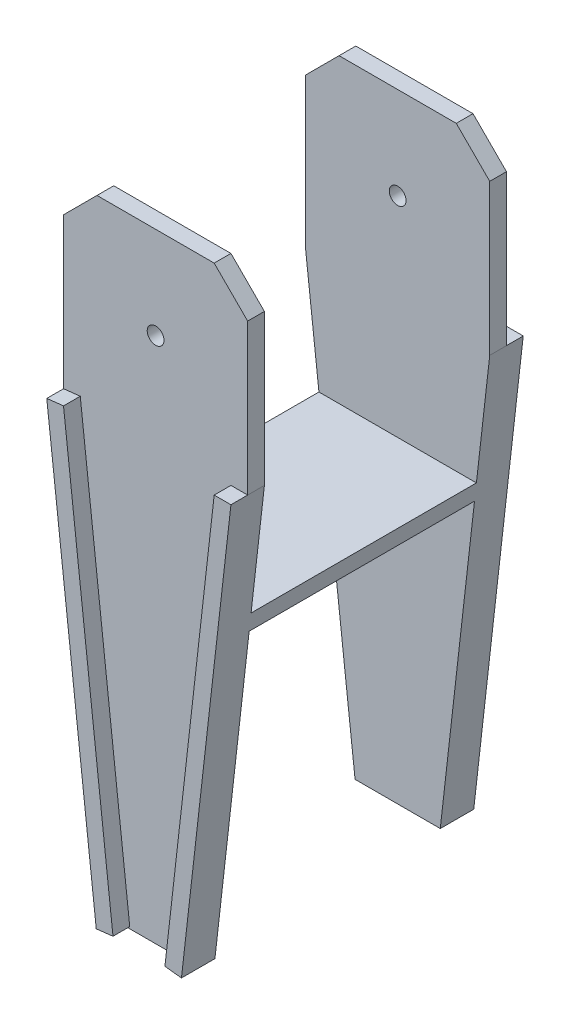
ISO-10303-21;
HEADER;
FILE_DESCRIPTION(('STEP AP214'),'2;1');
FILE_NAME('part.step','',(''),(''),'','','');
FILE_SCHEMA(('AUTOMOTIVE_DESIGN { 1 0 10303 214 1 1 1 1 }'));
ENDSEC;
DATA;
#1=APPLICATION_CONTEXT('core data for automotive mechanical design processes');
#2=APPLICATION_PROTOCOL_DEFINITION('international standard','automotive_design',2000,#1);
#3=PRODUCT_CONTEXT('',#1,'mechanical');
#4=PRODUCT('Part','Part','',(#3));
#5=PRODUCT_RELATED_PRODUCT_CATEGORY('part','',(#4));
#6=PRODUCT_DEFINITION_FORMATION('','',#4);
#7=PRODUCT_DEFINITION_CONTEXT('part definition',#1,'design');
#8=PRODUCT_DEFINITION('design','',#6,#7);
#9=PRODUCT_DEFINITION_SHAPE('','',#8);
#10=(LENGTH_UNIT() NAMED_UNIT(*) SI_UNIT(.MILLI.,.METRE.));
#11=(NAMED_UNIT(*) PLANE_ANGLE_UNIT() SI_UNIT($,.RADIAN.));
#12=(NAMED_UNIT(*) SI_UNIT($,.STERADIAN.) SOLID_ANGLE_UNIT());
#13=UNCERTAINTY_MEASURE_WITH_UNIT(LENGTH_MEASURE(1.E-05),#10,'distance_accuracy_value','');
#14=(GEOMETRIC_REPRESENTATION_CONTEXT(3) GLOBAL_UNCERTAINTY_ASSIGNED_CONTEXT((#13)) GLOBAL_UNIT_ASSIGNED_CONTEXT((#10,
#11,#12)) REPRESENTATION_CONTEXT('',''));
#15=CARTESIAN_POINT('',(0.,0.,0.));
#16=DIRECTION('',(0.,0.,1.));
#17=DIRECTION('',(1.,0.,0.));
#18=AXIS2_PLACEMENT_3D('',#15,#16,#17);
#19=CARTESIAN_POINT('',(0.,0.,-72.3));
#20=DIRECTION('',(0.,0.,-1.));
#21=DIRECTION('',(-1.,0.,0.));
#22=AXIS2_PLACEMENT_3D('',#19,#20,#21);
#23=PLANE('',#22);
#24=CARTESIAN_POINT('',(0.,0.,-72.3));
#25=DIRECTION('',(0.,0.,-1.));
#26=DIRECTION('',(-1.,0.,0.));
#27=AXIS2_PLACEMENT_3D('',#24,#25,#26);
#28=CIRCLE('',#27,2.5);
#29=CARTESIAN_POINT('',(-2.5,0.,-72.3));
#30=VERTEX_POINT('',#29);
#31=EDGE_CURVE('E388',#30,#30,#28,.T.);
#32=ORIENTED_EDGE('',*,*,#31,.F.);
#33=EDGE_LOOP('',(#32));
#34=FACE_BOUND('',#33,.T.);
#35=DIRECTION('',(0.113112723313677,-0.993582161587336,0.));
#36=VECTOR('',#35,1.);
#37=CARTESIAN_POINT('',(-7.75522216109794,-156.734436383432,-72.3));
#38=LINE('',#37,#36);
#39=CARTESIAN_POINT('',(-22.5320891920633,-26.9344363834316,-72.3));
#40=VERTEX_POINT('',#39);
#41=CARTESIAN_POINT('',(-7.75522216109794,-156.734436383432,-72.3));
#42=VERTEX_POINT('',#41);
#43=EDGE_CURVE('E697',#40,#42,#38,.T.);
#44=ORIENTED_EDGE('',*,*,#43,.F.);
#45=DIRECTION('',(0.993582161587336,0.113112723313677,0.));
#46=VECTOR('',#45,1.);
#47=CARTESIAN_POINT('',(-22.5320891920633,-26.9344363834316,-72.3));
#48=LINE('',#47,#46);
#49=CARTESIAN_POINT('',(-27.5,-27.5,-72.3));
#50=VERTEX_POINT('',#49);
#51=EDGE_CURVE('E269',#50,#40,#48,.T.);
#52=ORIENTED_EDGE('',*,*,#51,.F.);
#53=DIRECTION('',(0.,1.,0.));
#54=VECTOR('',#53,1.);
#55=CARTESIAN_POINT('',(-27.5,-157.3,-72.3));
#56=LINE('',#55,#54);
#57=CARTESIAN_POINT('',(-27.5,17.5,-72.3));
#58=VERTEX_POINT('',#57);
#59=EDGE_CURVE('E400',#50,#58,#56,.T.);
#60=ORIENTED_EDGE('',*,*,#59,.T.);
#61=DIRECTION('',(0.707106781186548,0.707106781186547,0.));
#62=VECTOR('',#61,1.);
#63=CARTESIAN_POINT('',(-27.5,17.5,-72.3));
#64=LINE('',#63,#62);
#65=CARTESIAN_POINT('',(-17.5,27.5,-72.3));
#66=VERTEX_POINT('',#65);
#67=EDGE_CURVE('E402',#58,#66,#64,.T.);
#68=ORIENTED_EDGE('',*,*,#67,.T.);
#69=DIRECTION('',(1.,0.,0.));
#70=VECTOR('',#69,1.);
#71=CARTESIAN_POINT('',(-17.5,27.5,-72.3));
#72=LINE('',#71,#70);
#73=CARTESIAN_POINT('',(17.5,27.5,-72.3));
#74=VERTEX_POINT('',#73);
#75=EDGE_CURVE('E404',#66,#74,#72,.T.);
#76=ORIENTED_EDGE('',*,*,#75,.T.);
#77=DIRECTION('',(0.707106781186548,-0.707106781186547,0.));
#78=VECTOR('',#77,1.);
#79=CARTESIAN_POINT('',(17.5,27.5,-72.3));
#80=LINE('',#79,#78);
#81=CARTESIAN_POINT('',(27.5,17.5,-72.3));
#82=VERTEX_POINT('',#81);
#83=EDGE_CURVE('E406',#74,#82,#80,.T.);
#84=ORIENTED_EDGE('',*,*,#83,.T.);
#85=DIRECTION('',(0.,-1.,0.));
#86=VECTOR('',#85,1.);
#87=CARTESIAN_POINT('',(27.5,17.5,-72.3));
#88=LINE('',#87,#86);
#89=CARTESIAN_POINT('',(27.5,-27.5,-72.3));
#90=VERTEX_POINT('',#89);
#91=EDGE_CURVE('E394',#82,#90,#88,.T.);
#92=ORIENTED_EDGE('',*,*,#91,.T.);
#93=DIRECTION('',(1.,0.,0.));
#94=VECTOR('',#93,1.);
#95=CARTESIAN_POINT('',(22.5,-27.5,-72.3));
#96=LINE('',#95,#94);
#97=CARTESIAN_POINT('',(22.5,-27.5,-72.3));
#98=VERTEX_POINT('',#97);
#99=EDGE_CURVE('E51',#98,#90,#96,.T.);
#100=ORIENTED_EDGE('',*,*,#99,.F.);
#101=DIRECTION('',(0.113112723313677,0.993582161587336,0.));
#102=VECTOR('',#101,1.);
#103=CARTESIAN_POINT('',(7.78710540991174,-156.738066079335,-72.3));
#104=LINE('',#103,#102);
#105=CARTESIAN_POINT('',(7.78710540991174,-156.738066079335,-72.3));
#106=VERTEX_POINT('',#105);
#107=EDGE_CURVE('E282',#106,#98,#104,.T.);
#108=ORIENTED_EDGE('',*,*,#107,.F.);
#109=DIRECTION('',(-0.993582161587336,0.113112723313676,0.));
#110=VECTOR('',#109,1.);
#111=CARTESIAN_POINT('',(12.7231329690346,-157.3,-72.3));
#112=LINE('',#111,#110);
#113=CARTESIAN_POINT('',(12.7231329690346,-157.3,-72.3));
#114=VERTEX_POINT('',#113);
#115=EDGE_CURVE('E272',#114,#106,#112,.T.);
#116=ORIENTED_EDGE('',*,*,#115,.F.);
#117=DIRECTION('',(-1.,0.,0.));
#118=VECTOR('',#117,1.);
#119=CARTESIAN_POINT('',(27.5,-157.3,-72.3));
#120=LINE('',#119,#118);
#121=CARTESIAN_POINT('',(-12.7231329690346,-157.3,-72.3));
#122=VERTEX_POINT('',#121);
#123=EDGE_CURVE('E396',#114,#122,#120,.T.);
#124=ORIENTED_EDGE('',*,*,#123,.T.);
#125=DIRECTION('',(-0.993582161587336,-0.113112723313675,0.));
#126=VECTOR('',#125,1.);
#127=CARTESIAN_POINT('',(-12.7231329690346,-157.3,-72.3));
#128=LINE('',#127,#126);
#129=EDGE_CURVE('E265',#42,#122,#128,.T.);
#130=ORIENTED_EDGE('',*,*,#129,.F.);
#131=EDGE_LOOP('',(#44,#52,#60,#68,#76,#84,#92,#100,#108,#116,#124,#130));
#132=FACE_BOUND('',#131,.T.);
#133=ADVANCED_FACE('F33',(#34,#132),#23,.T.);
#134=CARTESIAN_POINT('',(0.,0.,5.));
#135=DIRECTION('',(0.,0.,1.));
#136=DIRECTION('',(1.,0.,0.));
#137=AXIS2_PLACEMENT_3D('',#134,#135,#136);
#138=PLANE('',#137);
#139=CARTESIAN_POINT('',(0.,0.,5.));
#140=DIRECTION('',(0.,0.,1.));
#141=DIRECTION('',(1.,0.,0.));
#142=AXIS2_PLACEMENT_3D('',#139,#140,#141);
#143=CIRCLE('',#142,2.5);
#144=CARTESIAN_POINT('',(2.5,0.,5.));
#145=VERTEX_POINT('',#144);
#146=EDGE_CURVE('E487',#145,#145,#143,.T.);
#147=ORIENTED_EDGE('',*,*,#146,.F.);
#148=EDGE_LOOP('',(#147));
#149=FACE_BOUND('',#148,.T.);
#150=DIRECTION('',(0.,-1.,0.));
#151=VECTOR('',#150,1.);
#152=CARTESIAN_POINT('',(-27.5,17.5,5.));
#153=LINE('',#152,#151);
#154=CARTESIAN_POINT('',(-27.5,17.5,5.));
#155=VERTEX_POINT('',#154);
#156=CARTESIAN_POINT('',(-27.5,-27.5,5.));
#157=VERTEX_POINT('',#156);
#158=EDGE_CURVE('E469',#155,#157,#153,.T.);
#159=ORIENTED_EDGE('',*,*,#158,.T.);
#160=DIRECTION('',(-0.993582161587336,-0.113112723313678,0.));
#161=VECTOR('',#160,1.);
#162=CARTESIAN_POINT('',(-22.5,-26.9307832422587,5.));
#163=LINE('',#162,#161);
#164=CARTESIAN_POINT('',(-22.5,-26.9307832422587,5.));
#165=VERTEX_POINT('',#164);
#166=EDGE_CURVE('E303',#165,#157,#163,.T.);
#167=ORIENTED_EDGE('',*,*,#166,.F.);
#168=DIRECTION('',(-0.113112723313677,0.993582161587336,0.));
#169=VECTOR('',#168,1.);
#170=CARTESIAN_POINT('',(-7.72313296903456,-156.730783242259,5.));
#171=LINE('',#170,#169);
#172=CARTESIAN_POINT('',(-7.72313296903455,-156.730783242259,5.));
#173=VERTEX_POINT('',#172);
#174=EDGE_CURVE('E59',#173,#165,#171,.T.);
#175=ORIENTED_EDGE('',*,*,#174,.F.);
#176=DIRECTION('',(0.993582161587336,0.113112723313677,0.));
#177=VECTOR('',#176,1.);
#178=CARTESIAN_POINT('',(-12.7231329690346,-157.3,5.));
#179=LINE('',#178,#177);
#180=CARTESIAN_POINT('',(-12.7231329690346,-157.3,5.));
#181=VERTEX_POINT('',#180);
#182=EDGE_CURVE('E316',#181,#173,#179,.T.);
#183=ORIENTED_EDGE('',*,*,#182,.F.);
#184=DIRECTION('',(-1.,0.,0.));
#185=VECTOR('',#184,1.);
#186=CARTESIAN_POINT('',(-27.5,-157.3,5.));
#187=LINE('',#186,#185);
#188=CARTESIAN_POINT('',(12.7231329690346,-157.3,5.));
#189=VERTEX_POINT('',#188);
#190=EDGE_CURVE('E460',#189,#181,#187,.T.);
#191=ORIENTED_EDGE('',*,*,#190,.F.);
#192=DIRECTION('',(0.993582161587336,-0.113112723313678,0.));
#193=VECTOR('',#192,1.);
#194=CARTESIAN_POINT('',(12.7231329690346,-157.3,5.));
#195=LINE('',#194,#193);
#196=CARTESIAN_POINT('',(7.78710540991181,-156.738066079335,5.));
#197=VERTEX_POINT('',#196);
#198=EDGE_CURVE('E335',#197,#189,#195,.T.);
#199=ORIENTED_EDGE('',*,*,#198,.F.);
#200=DIRECTION('',(-0.113112723313677,-0.993582161587336,0.));
#201=VECTOR('',#200,1.);
#202=CARTESIAN_POINT('',(7.78710540991181,-156.738066079335,5.));
#203=LINE('',#202,#201);
#204=CARTESIAN_POINT('',(22.5,-27.5,5.));
#205=VERTEX_POINT('',#204);
#206=EDGE_CURVE('E344',#205,#197,#203,.T.);
#207=ORIENTED_EDGE('',*,*,#206,.F.);
#208=DIRECTION('',(-1.,0.,0.));
#209=VECTOR('',#208,1.);
#210=CARTESIAN_POINT('',(22.5,-27.5,5.));
#211=LINE('',#210,#209);
#212=CARTESIAN_POINT('',(27.5,-27.5,5.));
#213=VERTEX_POINT('',#212);
#214=EDGE_CURVE('E330',#213,#205,#211,.T.);
#215=ORIENTED_EDGE('',*,*,#214,.F.);
#216=DIRECTION('',(0.,1.,0.));
#217=VECTOR('',#216,1.);
#218=CARTESIAN_POINT('',(27.5,17.5,5.));
#219=LINE('',#218,#217);
#220=CARTESIAN_POINT('',(27.5,17.5,5.));
#221=VERTEX_POINT('',#220);
#222=EDGE_CURVE('E479',#213,#221,#219,.T.);
#223=ORIENTED_EDGE('',*,*,#222,.T.);
#224=DIRECTION('',(-0.707106781186548,0.707106781186547,0.));
#225=VECTOR('',#224,1.);
#226=CARTESIAN_POINT('',(17.5,27.5,5.));
#227=LINE('',#226,#225);
#228=CARTESIAN_POINT('',(17.5,27.5,5.));
#229=VERTEX_POINT('',#228);
#230=EDGE_CURVE('E477',#221,#229,#227,.T.);
#231=ORIENTED_EDGE('',*,*,#230,.T.);
#232=DIRECTION('',(-1.,0.,0.));
#233=VECTOR('',#232,1.);
#234=CARTESIAN_POINT('',(-17.5,27.5,5.));
#235=LINE('',#234,#233);
#236=CARTESIAN_POINT('',(-17.5,27.5,5.));
#237=VERTEX_POINT('',#236);
#238=EDGE_CURVE('E475',#229,#237,#235,.T.);
#239=ORIENTED_EDGE('',*,*,#238,.T.);
#240=DIRECTION('',(-0.707106781186548,-0.707106781186547,0.));
#241=VECTOR('',#240,1.);
#242=CARTESIAN_POINT('',(-27.5,17.5,5.));
#243=LINE('',#242,#241);
#244=EDGE_CURVE('E473',#237,#155,#243,.T.);
#245=ORIENTED_EDGE('',*,*,#244,.T.);
#246=EDGE_LOOP('',(#159,#167,#175,#183,#191,#199,#207,#215,#223,#231,#239,#245));
#247=FACE_BOUND('',#246,.T.);
#248=ADVANCED_FACE('F522',(#149,#247),#138,.T.);
#249=CARTESIAN_POINT('',(0.,0.,0.));
#250=DIRECTION('',(0.,0.,1.));
#251=DIRECTION('',(1.,0.,0.));
#252=AXIS2_PLACEMENT_3D('',#249,#250,#251);
#253=PLANE('',#252);
#254=CARTESIAN_POINT('',(0.,0.,0.));
#255=DIRECTION('',(0.,0.,1.));
#256=DIRECTION('',(1.,0.,0.));
#257=AXIS2_PLACEMENT_3D('',#254,#255,#256);
#258=CIRCLE('',#257,2.5);
#259=CARTESIAN_POINT('',(2.5,0.,0.));
#260=VERTEX_POINT('',#259);
#261=EDGE_CURVE('E482',#260,#260,#258,.T.);
#262=ORIENTED_EDGE('',*,*,#261,.T.);
#263=EDGE_LOOP('',(#262));
#264=FACE_BOUND('',#263,.T.);
#265=DIRECTION('',(1.,0.,0.));
#266=VECTOR('',#265,1.);
#267=CARTESIAN_POINT('',(23.5154826958106,-62.5,0.));
#268=LINE('',#267,#266);
#269=CARTESIAN_POINT('',(-23.5154826958106,-62.5,0.));
#270=VERTEX_POINT('',#269);
#271=CARTESIAN_POINT('',(23.5154826958106,-62.5,0.));
#272=VERTEX_POINT('',#271);
#273=EDGE_CURVE('E486',#270,#272,#268,.T.);
#274=ORIENTED_EDGE('',*,*,#273,.F.);
#275=DIRECTION('',(-0.113112723313677,0.993582161587336,0.));
#276=VECTOR('',#275,1.);
#277=CARTESIAN_POINT('',(-30.2387881388339,-3.44248498848292,0.));
#278=LINE('',#277,#276);
#279=CARTESIAN_POINT('',(-27.5,-27.5,0.));
#280=VERTEX_POINT('',#279);
#281=EDGE_CURVE('E502',#270,#280,#278,.T.);
#282=ORIENTED_EDGE('',*,*,#281,.T.);
#283=DIRECTION('',(0.,-1.,0.));
#284=VECTOR('',#283,1.);
#285=CARTESIAN_POINT('',(-27.5,17.5,0.));
#286=LINE('',#285,#284);
#287=CARTESIAN_POINT('',(-27.5,17.5,0.));
#288=VERTEX_POINT('',#287);
#289=EDGE_CURVE('E461',#288,#280,#286,.T.);
#290=ORIENTED_EDGE('',*,*,#289,.F.);
#291=DIRECTION('',(-0.707106781186548,-0.707106781186547,0.));
#292=VECTOR('',#291,1.);
#293=CARTESIAN_POINT('',(-27.5,17.5,0.));
#294=LINE('',#293,#292);
#295=CARTESIAN_POINT('',(-17.5,27.5,0.));
#296=VERTEX_POINT('',#295);
#297=EDGE_CURVE('E651',#296,#288,#294,.T.);
#298=ORIENTED_EDGE('',*,*,#297,.F.);
#299=DIRECTION('',(-1.,0.,0.));
#300=VECTOR('',#299,1.);
#301=CARTESIAN_POINT('',(-17.5,27.5,0.));
#302=LINE('',#301,#300);
#303=CARTESIAN_POINT('',(17.5,27.5,0.));
#304=VERTEX_POINT('',#303);
#305=EDGE_CURVE('E643',#304,#296,#302,.T.);
#306=ORIENTED_EDGE('',*,*,#305,.F.);
#307=DIRECTION('',(-0.707106781186548,0.707106781186547,0.));
#308=VECTOR('',#307,1.);
#309=CARTESIAN_POINT('',(17.5,27.5,0.));
#310=LINE('',#309,#308);
#311=CARTESIAN_POINT('',(27.5,17.5,0.));
#312=VERTEX_POINT('',#311);
#313=EDGE_CURVE('E467',#312,#304,#310,.T.);
#314=ORIENTED_EDGE('',*,*,#313,.F.);
#315=DIRECTION('',(0.,1.,0.));
#316=VECTOR('',#315,1.);
#317=CARTESIAN_POINT('',(27.5,17.5,0.));
#318=LINE('',#317,#316);
#319=CARTESIAN_POINT('',(27.5,-27.4999999999999,0.));
#320=VERTEX_POINT('',#319);
#321=EDGE_CURVE('E456',#320,#312,#318,.T.);
#322=ORIENTED_EDGE('',*,*,#321,.F.);
#323=DIRECTION('',(-0.113112723313677,-0.993582161587336,0.));
#324=VECTOR('',#323,1.);
#325=CARTESIAN_POINT('',(30.2387881388339,-3.44248498848291,0.));
#326=LINE('',#325,#324);
#327=EDGE_CURVE('E507',#320,#272,#326,.T.);
#328=ORIENTED_EDGE('',*,*,#327,.T.);
#329=EDGE_LOOP('',(#274,#282,#290,#298,#306,#314,#322,#328));
#330=FACE_BOUND('',#329,.T.);
#331=ADVANCED_FACE('F556',(#264,#330),#253,.F.);
#332=DIRECTION('',(-1.,0.,0.));
#333=VECTOR('',#332,1.);
#334=CARTESIAN_POINT('',(-22.9462659380692,-67.5,0.));
#335=LINE('',#334,#333);
#336=CARTESIAN_POINT('',(22.9462659380692,-67.5,0.));
#337=VERTEX_POINT('',#336);
#338=CARTESIAN_POINT('',(-22.9462659380692,-67.5,0.));
#339=VERTEX_POINT('',#338);
#340=EDGE_CURVE('E667',#337,#339,#335,.T.);
#341=ORIENTED_EDGE('',*,*,#340,.F.);
#342=CARTESIAN_POINT('',(12.7231329690346,-157.3,0.));
#343=VERTEX_POINT('',#342);
#344=EDGE_CURVE('E485',#337,#343,#326,.T.);
#345=ORIENTED_EDGE('',*,*,#344,.T.);
#346=DIRECTION('',(1.,0.,0.));
#347=VECTOR('',#346,1.);
#348=CARTESIAN_POINT('',(-27.5,-157.3,0.));
#349=LINE('',#348,#347);
#350=CARTESIAN_POINT('',(-12.7231329690346,-157.3,0.));
#351=VERTEX_POINT('',#350);
#352=EDGE_CURVE('E472',#351,#343,#349,.T.);
#353=ORIENTED_EDGE('',*,*,#352,.F.);
#354=EDGE_CURVE('E481',#351,#339,#278,.T.);
#355=ORIENTED_EDGE('',*,*,#354,.T.);
#356=EDGE_LOOP('',(#341,#345,#353,#355));
#357=FACE_BOUND('',#356,.T.);
#358=ADVANCED_FACE('F614',(#357),#253,.F.);
#359=CARTESIAN_POINT('',(0.,-157.3,0.));
#360=DIRECTION('',(0.,-1.,0.));
#361=DIRECTION('',(0.,0.,-1.));
#362=AXIS2_PLACEMENT_3D('',#359,#360,#361);
#363=PLANE('',#362);
#364=ORIENTED_EDGE('',*,*,#352,.T.);
#365=DIRECTION('',(0.,0.,1.));
#366=VECTOR('',#365,1.);
#367=CARTESIAN_POINT('',(12.7231329690346,-157.3,-72.301));
#368=LINE('',#367,#366);
#369=EDGE_CURVE('E493',#343,#189,#368,.T.);
#370=ORIENTED_EDGE('',*,*,#369,.T.);
#371=ORIENTED_EDGE('',*,*,#190,.T.);
#372=DIRECTION('',(0.,0.,1.));
#373=VECTOR('',#372,1.);
#374=CARTESIAN_POINT('',(-12.7231329690346,-157.3,-72.301));
#375=LINE('',#374,#373);
#376=EDGE_CURVE('E43',#351,#181,#375,.T.);
#377=ORIENTED_EDGE('',*,*,#376,.F.);
#378=EDGE_LOOP('',(#364,#370,#371,#377));
#379=FACE_BOUND('',#378,.T.);
#380=ADVANCED_FACE('F520',(#379),#363,.T.);
#381=CARTESIAN_POINT('',(27.5,17.5,5.));
#382=DIRECTION('',(-1.,0.,0.));
#383=DIRECTION('',(0.,-1.,0.));
#384=AXIS2_PLACEMENT_3D('',#381,#382,#383);
#385=PLANE('',#384);
#386=DIRECTION('',(0.,0.,1.));
#387=VECTOR('',#386,1.);
#388=CARTESIAN_POINT('',(27.5,-27.5,-72.301));
#389=LINE('',#388,#387);
#390=EDGE_CURVE('E11',#320,#213,#389,.T.);
#391=ORIENTED_EDGE('',*,*,#390,.F.);
#392=ORIENTED_EDGE('',*,*,#321,.T.);
#393=DIRECTION('',(0.,0.,-1.));
#394=VECTOR('',#393,1.);
#395=CARTESIAN_POINT('',(27.5,17.5,5.));
#396=LINE('',#395,#394);
#397=EDGE_CURVE('E646',#221,#312,#396,.T.);
#398=ORIENTED_EDGE('',*,*,#397,.F.);
#399=ORIENTED_EDGE('',*,*,#222,.F.);
#400=EDGE_LOOP('',(#391,#392,#398,#399));
#401=FACE_BOUND('',#400,.T.);
#402=ADVANCED_FACE('F622',(#401),#385,.F.);
#403=CARTESIAN_POINT('',(-27.5,17.5,5.));
#404=DIRECTION('',(1.,0.,0.));
#405=DIRECTION('',(0.,1.,0.));
#406=AXIS2_PLACEMENT_3D('',#403,#404,#405);
#407=PLANE('',#406);
#408=DIRECTION('',(0.,0.,1.));
#409=VECTOR('',#408,1.);
#410=CARTESIAN_POINT('',(-27.5,-27.5,-72.301));
#411=LINE('',#410,#409);
#412=EDGE_CURVE('E459',#280,#157,#411,.T.);
#413=ORIENTED_EDGE('',*,*,#412,.T.);
#414=ORIENTED_EDGE('',*,*,#158,.F.);
#415=DIRECTION('',(0.,0.,-1.));
#416=VECTOR('',#415,1.);
#417=CARTESIAN_POINT('',(-27.5,17.5,5.));
#418=LINE('',#417,#416);
#419=EDGE_CURVE('E510',#155,#288,#418,.T.);
#420=ORIENTED_EDGE('',*,*,#419,.T.);
#421=ORIENTED_EDGE('',*,*,#289,.T.);
#422=EDGE_LOOP('',(#413,#414,#420,#421));
#423=FACE_BOUND('',#422,.T.);
#424=ADVANCED_FACE('F603',(#423),#407,.F.);
#425=CARTESIAN_POINT('',(17.5,27.5,5.));
#426=DIRECTION('',(-0.707106781186547,-0.707106781186548,0.));
#427=DIRECTION('',(0.707106781186548,-0.707106781186547,0.));
#428=AXIS2_PLACEMENT_3D('',#425,#426,#427);
#429=PLANE('',#428);
#430=ORIENTED_EDGE('',*,*,#313,.T.);
#431=DIRECTION('',(0.,0.,-1.));
#432=VECTOR('',#431,1.);
#433=CARTESIAN_POINT('',(17.5,27.5,5.));
#434=LINE('',#433,#432);
#435=EDGE_CURVE('E648',#229,#304,#434,.T.);
#436=ORIENTED_EDGE('',*,*,#435,.F.);
#437=ORIENTED_EDGE('',*,*,#230,.F.);
#438=ORIENTED_EDGE('',*,*,#397,.T.);
#439=EDGE_LOOP('',(#430,#436,#437,#438));
#440=FACE_BOUND('',#439,.T.);
#441=ADVANCED_FACE('F599',(#440),#429,.F.);
#442=CARTESIAN_POINT('',(-17.5,27.5,5.));
#443=DIRECTION('',(0.,-1.,0.));
#444=DIRECTION('',(0.,0.,-1.));
#445=AXIS2_PLACEMENT_3D('',#442,#443,#444);
#446=PLANE('',#445);
#447=ORIENTED_EDGE('',*,*,#305,.T.);
#448=DIRECTION('',(0.,0.,-1.));
#449=VECTOR('',#448,1.);
#450=CARTESIAN_POINT('',(-17.5,27.5,5.));
#451=LINE('',#450,#449);
#452=EDGE_CURVE('E490',#237,#296,#451,.T.);
#453=ORIENTED_EDGE('',*,*,#452,.F.);
#454=ORIENTED_EDGE('',*,*,#238,.F.);
#455=ORIENTED_EDGE('',*,*,#435,.T.);
#456=EDGE_LOOP('',(#447,#453,#454,#455));
#457=FACE_BOUND('',#456,.T.);
#458=ADVANCED_FACE('F602',(#457),#446,.F.);
#459=CARTESIAN_POINT('',(-27.5,17.5,5.));
#460=DIRECTION('',(0.707106781186547,-0.707106781186548,0.));
#461=DIRECTION('',(0.707106781186548,0.707106781186547,0.));
#462=AXIS2_PLACEMENT_3D('',#459,#460,#461);
#463=PLANE('',#462);
#464=ORIENTED_EDGE('',*,*,#297,.T.);
#465=ORIENTED_EDGE('',*,*,#419,.F.);
#466=ORIENTED_EDGE('',*,*,#244,.F.);
#467=ORIENTED_EDGE('',*,*,#452,.T.);
#468=EDGE_LOOP('',(#464,#465,#466,#467));
#469=FACE_BOUND('',#468,.T.);
#470=ADVANCED_FACE('F607',(#469),#463,.F.);
#471=CARTESIAN_POINT('',(0.,0.,5.));
#472=DIRECTION('',(0.,0.,-1.));
#473=DIRECTION('',(-1.,0.,0.));
#474=AXIS2_PLACEMENT_3D('',#471,#472,#473);
#475=CYLINDRICAL_SURFACE('',#474,2.5);
#476=ORIENTED_EDGE('',*,*,#146,.T.);
#477=EDGE_LOOP('',(#476));
#478=FACE_BOUND('',#477,.T.);
#479=ORIENTED_EDGE('',*,*,#261,.F.);
#480=EDGE_LOOP('',(#479));
#481=FACE_BOUND('',#480,.T.);
#482=ADVANCED_FACE('F611',(#478,#481),#475,.F.);
#483=CARTESIAN_POINT('',(-30.2387881388339,-3.44248498848292,-72.301));
#484=DIRECTION('',(-0.993582161587336,-0.113112723313677,0.));
#485=DIRECTION('',(0.113112723313677,-0.993582161587336,0.));
#486=AXIS2_PLACEMENT_3D('',#483,#484,#485);
#487=PLANE('',#486);
#488=ORIENTED_EDGE('',*,*,#354,.F.);
#489=ORIENTED_EDGE('',*,*,#376,.T.);
#490=DIRECTION('',(0.,0.,-1.));
#491=VECTOR('',#490,1.);
#492=CARTESIAN_POINT('',(-12.7231329690346,-157.3,10.));
#493=LINE('',#492,#491);
#494=CARTESIAN_POINT('',(-12.7231329690346,-157.3,10.));
#495=VERTEX_POINT('',#494);
#496=EDGE_CURVE('E324',#495,#181,#493,.T.);
#497=ORIENTED_EDGE('',*,*,#496,.F.);
#498=DIRECTION('',(0.113112723313677,-0.993582161587336,0.));
#499=VECTOR('',#498,1.);
#500=CARTESIAN_POINT('',(-27.5,-27.5,10.));
#501=LINE('',#500,#499);
#502=CARTESIAN_POINT('',(-27.5,-27.5,10.));
#503=VERTEX_POINT('',#502);
#504=EDGE_CURVE('E307',#503,#495,#501,.T.);
#505=ORIENTED_EDGE('',*,*,#504,.F.);
#506=DIRECTION('',(0.,0.,-1.));
#507=VECTOR('',#506,1.);
#508=CARTESIAN_POINT('',(-27.5,-27.5,10.));
#509=LINE('',#508,#507);
#510=EDGE_CURVE('E327',#503,#157,#509,.T.);
#511=ORIENTED_EDGE('',*,*,#510,.T.);
#512=ORIENTED_EDGE('',*,*,#412,.F.);
#513=ORIENTED_EDGE('',*,*,#281,.F.);
#514=DIRECTION('',(0.,0.,1.));
#515=VECTOR('',#514,1.);
#516=CARTESIAN_POINT('',(-23.5154826958106,-62.5,-500000.));
#517=LINE('',#516,#515);
#518=CARTESIAN_POINT('',(-23.5154826958106,-62.5,-67.3000000001025));
#519=VERTEX_POINT('',#518);
#520=EDGE_CURVE('E664',#519,#270,#517,.T.);
#521=ORIENTED_EDGE('',*,*,#520,.F.);
#522=DIRECTION('',(0.113112723313677,-0.993582161587336,0.));
#523=VECTOR('',#522,1.);
#524=CARTESIAN_POINT('',(-30.2387881388339,-3.44248498848292,-67.3));
#525=LINE('',#524,#523);
#526=CARTESIAN_POINT('',(-27.5,-27.5,-67.3));
#527=VERTEX_POINT('',#526);
#528=EDGE_CURVE('E376',#527,#519,#525,.T.);
#529=ORIENTED_EDGE('',*,*,#528,.F.);
#530=DIRECTION('',(0.,0.,1.));
#531=VECTOR('',#530,1.);
#532=CARTESIAN_POINT('',(-27.5,-27.5,-72.301));
#533=LINE('',#532,#531);
#534=EDGE_CURVE('E385',#50,#527,#533,.T.);
#535=ORIENTED_EDGE('',*,*,#534,.F.);
#536=DIRECTION('',(0.,0.,1.));
#537=VECTOR('',#536,1.);
#538=CARTESIAN_POINT('',(-27.5,-27.5,-77.3));
#539=LINE('',#538,#537);
#540=CARTESIAN_POINT('',(-27.5,-27.5,-77.3));
#541=VERTEX_POINT('',#540);
#542=EDGE_CURVE('E694',#541,#50,#539,.T.);
#543=ORIENTED_EDGE('',*,*,#542,.F.);
#544=DIRECTION('',(-0.113112723313677,0.993582161587336,0.));
#545=VECTOR('',#544,1.);
#546=CARTESIAN_POINT('',(-27.5,-27.5,-77.3));
#547=LINE('',#546,#545);
#548=CARTESIAN_POINT('',(-12.7231329690346,-157.3,-77.3));
#549=VERTEX_POINT('',#548);
#550=EDGE_CURVE('E262',#549,#541,#547,.T.);
#551=ORIENTED_EDGE('',*,*,#550,.F.);
#552=DIRECTION('',(0.,0.,1.));
#553=VECTOR('',#552,1.);
#554=CARTESIAN_POINT('',(-12.7231329690346,-157.3,-77.3));
#555=LINE('',#554,#553);
#556=EDGE_CURVE('E274',#549,#122,#555,.T.);
#557=ORIENTED_EDGE('',*,*,#556,.T.);
#558=DIRECTION('',(0.,0.,1.));
#559=VECTOR('',#558,1.);
#560=CARTESIAN_POINT('',(-12.7231329690346,-157.3,-72.301));
#561=LINE('',#560,#559);
#562=CARTESIAN_POINT('',(-12.7231329690346,-157.3,-67.3));
#563=VERTEX_POINT('',#562);
#564=EDGE_CURVE('E380',#122,#563,#561,.T.);
#565=ORIENTED_EDGE('',*,*,#564,.T.);
#566=CARTESIAN_POINT('',(-22.9462659380692,-67.5,-67.3000000001025));
#567=VERTEX_POINT('',#566);
#568=EDGE_CURVE('E373',#567,#563,#525,.T.);
#569=ORIENTED_EDGE('',*,*,#568,.F.);
#570=DIRECTION('',(0.,0.,1.));
#571=VECTOR('',#570,1.);
#572=CARTESIAN_POINT('',(-22.9462659380692,-67.5,-500000.));
#573=LINE('',#572,#571);
#574=EDGE_CURVE('E666',#567,#339,#573,.T.);
#575=ORIENTED_EDGE('',*,*,#574,.T.);
#576=EDGE_LOOP('',(#488,#489,#497,#505,#511,#512,#513,#521,#529,#535,#543,#551,#557,#565,#569,#575));
#577=FACE_BOUND('',#576,.T.);
#578=ADVANCED_FACE('F514',(#577),#487,.T.);
#579=CARTESIAN_POINT('',(30.2387881388339,-3.44248498848291,-72.301));
#580=DIRECTION('',(0.993582161587336,-0.113112723313677,0.));
#581=DIRECTION('',(0.113112723313677,0.993582161587336,0.));
#582=AXIS2_PLACEMENT_3D('',#579,#580,#581);
#583=PLANE('',#582);
#584=ORIENTED_EDGE('',*,*,#369,.F.);
#585=ORIENTED_EDGE('',*,*,#344,.F.);
#586=DIRECTION('',(0.,0.,1.));
#587=VECTOR('',#586,1.);
#588=CARTESIAN_POINT('',(22.9462659380692,-67.5,-500000.));
#589=LINE('',#588,#587);
#590=CARTESIAN_POINT('',(22.9462659380692,-67.5,-67.3000000001025));
#591=VERTEX_POINT('',#590);
#592=EDGE_CURVE('E447',#591,#337,#589,.T.);
#593=ORIENTED_EDGE('',*,*,#592,.F.);
#594=DIRECTION('',(0.113112723313677,0.993582161587336,0.));
#595=VECTOR('',#594,1.);
#596=CARTESIAN_POINT('',(30.2387881388339,-3.44248498848291,-67.3));
#597=LINE('',#596,#595);
#598=CARTESIAN_POINT('',(12.7231329690346,-157.3,-67.3));
#599=VERTEX_POINT('',#598);
#600=EDGE_CURVE('E369',#599,#591,#597,.T.);
#601=ORIENTED_EDGE('',*,*,#600,.F.);
#602=DIRECTION('',(0.,0.,1.));
#603=VECTOR('',#602,1.);
#604=CARTESIAN_POINT('',(12.7231329690346,-157.3,-72.301));
#605=LINE('',#604,#603);
#606=EDGE_CURVE('E372',#114,#599,#605,.T.);
#607=ORIENTED_EDGE('',*,*,#606,.F.);
#608=DIRECTION('',(0.,0.,1.));
#609=VECTOR('',#608,1.);
#610=CARTESIAN_POINT('',(12.7231329690346,-157.3,-77.3));
#611=LINE('',#610,#609);
#612=CARTESIAN_POINT('',(12.7231329690346,-157.3,-77.3));
#613=VERTEX_POINT('',#612);
#614=EDGE_CURVE('E297',#613,#114,#611,.T.);
#615=ORIENTED_EDGE('',*,*,#614,.F.);
#616=DIRECTION('',(-0.113112723313677,-0.993582161587336,0.));
#617=VECTOR('',#616,1.);
#618=CARTESIAN_POINT('',(27.5,-27.5,-77.3));
#619=LINE('',#618,#617);
#620=CARTESIAN_POINT('',(27.5,-27.5,-77.3));
#621=VERTEX_POINT('',#620);
#622=EDGE_CURVE('E281',#621,#613,#619,.T.);
#623=ORIENTED_EDGE('',*,*,#622,.F.);
#624=DIRECTION('',(0.,0.,1.));
#625=VECTOR('',#624,1.);
#626=CARTESIAN_POINT('',(27.5,-27.5,-77.3));
#627=LINE('',#626,#625);
#628=EDGE_CURVE('E300',#621,#90,#627,.T.);
#629=ORIENTED_EDGE('',*,*,#628,.T.);
#630=DIRECTION('',(0.,0.,1.));
#631=VECTOR('',#630,1.);
#632=CARTESIAN_POINT('',(27.5,-27.5,-72.301));
#633=LINE('',#632,#631);
#634=CARTESIAN_POINT('',(27.5,-27.5,-67.3));
#635=VERTEX_POINT('',#634);
#636=EDGE_CURVE('E363',#90,#635,#633,.T.);
#637=ORIENTED_EDGE('',*,*,#636,.T.);
#638=CARTESIAN_POINT('',(23.5154826958106,-62.5,-67.3));
#639=VERTEX_POINT('',#638);
#640=EDGE_CURVE('E360',#639,#635,#597,.T.);
#641=ORIENTED_EDGE('',*,*,#640,.F.);
#642=DIRECTION('',(0.,0.,1.));
#643=VECTOR('',#642,1.);
#644=CARTESIAN_POINT('',(23.5154826958106,-62.5,-500000.));
#645=LINE('',#644,#643);
#646=EDGE_CURVE('E665',#639,#272,#645,.T.);
#647=ORIENTED_EDGE('',*,*,#646,.T.);
#648=ORIENTED_EDGE('',*,*,#327,.F.);
#649=ORIENTED_EDGE('',*,*,#390,.T.);
#650=DIRECTION('',(0.,0.,-1.));
#651=VECTOR('',#650,1.);
#652=CARTESIAN_POINT('',(27.5,-27.5,10.));
#653=LINE('',#652,#651);
#654=CARTESIAN_POINT('',(27.5,-27.5,10.));
#655=VERTEX_POINT('',#654);
#656=EDGE_CURVE('E341',#655,#213,#653,.T.);
#657=ORIENTED_EDGE('',*,*,#656,.F.);
#658=DIRECTION('',(0.113112723313677,0.993582161587336,0.));
#659=VECTOR('',#658,1.);
#660=CARTESIAN_POINT('',(27.5,-27.5,10.));
#661=LINE('',#660,#659);
#662=CARTESIAN_POINT('',(12.7231329690346,-157.3,10.));
#663=VERTEX_POINT('',#662);
#664=EDGE_CURVE('E339',#663,#655,#661,.T.);
#665=ORIENTED_EDGE('',*,*,#664,.F.);
#666=DIRECTION('',(0.,0.,-1.));
#667=VECTOR('',#666,1.);
#668=CARTESIAN_POINT('',(12.7231329690346,-157.3,10.));
#669=LINE('',#668,#667);
#670=EDGE_CURVE('E351',#663,#189,#669,.T.);
#671=ORIENTED_EDGE('',*,*,#670,.T.);
#672=EDGE_LOOP('',(#584,#585,#593,#601,#607,#615,#623,#629,#637,#641,#647,#648,#649,#657,#665,#671));
#673=FACE_BOUND('',#672,.T.);
#674=ADVANCED_FACE('F35',(#673),#583,.T.);
#675=CARTESIAN_POINT('',(-22.9462659380692,-67.5,-500000.));
#676=DIRECTION('',(0.,1.,0.));
#677=DIRECTION('',(0.,0.,1.));
#678=AXIS2_PLACEMENT_3D('',#675,#676,#677);
#679=PLANE('',#678);
#680=DIRECTION('',(-1.,0.,0.));
#681=VECTOR('',#680,1.);
#682=CARTESIAN_POINT('',(-22.9462659380692,-67.5,-67.2999999999888));
#683=LINE('',#682,#681);
#684=EDGE_CURVE('E37',#591,#567,#683,.T.);
#685=ORIENTED_EDGE('',*,*,#684,.F.);
#686=ORIENTED_EDGE('',*,*,#592,.T.);
#687=ORIENTED_EDGE('',*,*,#340,.T.);
#688=ORIENTED_EDGE('',*,*,#574,.F.);
#689=EDGE_LOOP('',(#685,#686,#687,#688));
#690=FACE_BOUND('',#689,.T.);
#691=ADVANCED_FACE('F570',(#690),#679,.F.);
#692=CARTESIAN_POINT('',(23.5154826958106,-62.5,-500000.));
#693=DIRECTION('',(0.,-1.,0.));
#694=DIRECTION('',(0.,0.,-1.));
#695=AXIS2_PLACEMENT_3D('',#692,#693,#694);
#696=PLANE('',#695);
#697=DIRECTION('',(1.,0.,0.));
#698=VECTOR('',#697,1.);
#699=CARTESIAN_POINT('',(23.5154826958106,-62.5,-67.2999999999888));
#700=LINE('',#699,#698);
#701=EDGE_CURVE('E437',#519,#639,#700,.T.);
#702=ORIENTED_EDGE('',*,*,#701,.F.);
#703=ORIENTED_EDGE('',*,*,#520,.T.);
#704=ORIENTED_EDGE('',*,*,#273,.T.);
#705=ORIENTED_EDGE('',*,*,#646,.F.);
#706=EDGE_LOOP('',(#702,#703,#704,#705));
#707=FACE_BOUND('',#706,.T.);
#708=ADVANCED_FACE('F568',(#707),#696,.F.);
#709=CARTESIAN_POINT('',(0.,0.,-67.3));
#710=DIRECTION('',(0.,0.,-1.));
#711=DIRECTION('',(-1.,0.,0.));
#712=AXIS2_PLACEMENT_3D('',#709,#710,#711);
#713=PLANE('',#712);
#714=ORIENTED_EDGE('',*,*,#600,.T.);
#715=ORIENTED_EDGE('',*,*,#684,.T.);
#716=ORIENTED_EDGE('',*,*,#568,.T.);
#717=DIRECTION('',(-1.,0.,0.));
#718=VECTOR('',#717,1.);
#719=CARTESIAN_POINT('',(27.5,-157.3,-67.3));
#720=LINE('',#719,#718);
#721=EDGE_CURVE('E411',#599,#563,#720,.T.);
#722=ORIENTED_EDGE('',*,*,#721,.F.);
#723=EDGE_LOOP('',(#714,#715,#716,#722));
#724=FACE_BOUND('',#723,.T.);
#725=ADVANCED_FACE('F564',(#724),#713,.F.);
#726=CARTESIAN_POINT('',(0.,0.,-67.3));
#727=DIRECTION('',(0.,0.,-1.));
#728=DIRECTION('',(-1.,0.,0.));
#729=AXIS2_PLACEMENT_3D('',#726,#727,#728);
#730=CIRCLE('',#729,2.5);
#731=CARTESIAN_POINT('',(-2.5,0.,-67.3));
#732=VERTEX_POINT('',#731);
#733=EDGE_CURVE('E384',#732,#732,#730,.T.);
#734=ORIENTED_EDGE('',*,*,#733,.T.);
#735=EDGE_LOOP('',(#734));
#736=FACE_BOUND('',#735,.T.);
#737=ORIENTED_EDGE('',*,*,#528,.T.);
#738=ORIENTED_EDGE('',*,*,#701,.T.);
#739=ORIENTED_EDGE('',*,*,#640,.T.);
#740=DIRECTION('',(0.,-1.,0.));
#741=VECTOR('',#740,1.);
#742=CARTESIAN_POINT('',(27.5,17.5,-67.3));
#743=LINE('',#742,#741);
#744=CARTESIAN_POINT('',(27.5,17.5,-67.3));
#745=VERTEX_POINT('',#744);
#746=EDGE_CURVE('E391',#745,#635,#743,.T.);
#747=ORIENTED_EDGE('',*,*,#746,.F.);
#748=DIRECTION('',(0.707106781186548,-0.707106781186547,0.));
#749=VECTOR('',#748,1.);
#750=CARTESIAN_POINT('',(17.5,27.5,-67.3));
#751=LINE('',#750,#749);
#752=CARTESIAN_POINT('',(17.5,27.5,-67.3));
#753=VERTEX_POINT('',#752);
#754=EDGE_CURVE('E397',#753,#745,#751,.T.);
#755=ORIENTED_EDGE('',*,*,#754,.F.);
#756=DIRECTION('',(1.,0.,0.));
#757=VECTOR('',#756,1.);
#758=CARTESIAN_POINT('',(-17.5,27.5,-67.3));
#759=LINE('',#758,#757);
#760=CARTESIAN_POINT('',(-17.5,27.5,-67.3));
#761=VERTEX_POINT('',#760);
#762=EDGE_CURVE('E423',#761,#753,#759,.T.);
#763=ORIENTED_EDGE('',*,*,#762,.F.);
#764=DIRECTION('',(0.707106781186548,0.707106781186547,0.));
#765=VECTOR('',#764,1.);
#766=CARTESIAN_POINT('',(-27.5,17.5,-67.3));
#767=LINE('',#766,#765);
#768=CARTESIAN_POINT('',(-27.5,17.5,-67.3));
#769=VERTEX_POINT('',#768);
#770=EDGE_CURVE('E419',#769,#761,#767,.T.);
#771=ORIENTED_EDGE('',*,*,#770,.F.);
#772=DIRECTION('',(0.,1.,0.));
#773=VECTOR('',#772,1.);
#774=CARTESIAN_POINT('',(-27.5,-157.3,-67.3));
#775=LINE('',#774,#773);
#776=EDGE_CURVE('E418',#527,#769,#775,.T.);
#777=ORIENTED_EDGE('',*,*,#776,.F.);
#778=EDGE_LOOP('',(#737,#738,#739,#747,#755,#763,#771,#777));
#779=FACE_BOUND('',#778,.T.);
#780=ADVANCED_FACE('F567',(#736,#779),#713,.F.);
#781=CARTESIAN_POINT('',(27.5,-157.3,-72.3));
#782=DIRECTION('',(0.,1.,0.));
#783=DIRECTION('',(0.,0.,1.));
#784=AXIS2_PLACEMENT_3D('',#781,#782,#783);
#785=PLANE('',#784);
#786=ORIENTED_EDGE('',*,*,#606,.T.);
#787=ORIENTED_EDGE('',*,*,#721,.T.);
#788=ORIENTED_EDGE('',*,*,#564,.F.);
#789=ORIENTED_EDGE('',*,*,#123,.F.);
#790=EDGE_LOOP('',(#786,#787,#788,#789));
#791=FACE_BOUND('',#790,.T.);
#792=ADVANCED_FACE('F583',(#791),#785,.F.);
#793=CARTESIAN_POINT('',(-27.5,17.5,5.));
#794=DIRECTION('',(1.,0.,0.));
#795=DIRECTION('',(0.,1.,0.));
#796=AXIS2_PLACEMENT_3D('',#793,#794,#795);
#797=PLANE('',#796);
#798=ORIENTED_EDGE('',*,*,#534,.T.);
#799=ORIENTED_EDGE('',*,*,#776,.T.);
#800=DIRECTION('',(0.,0.,1.));
#801=VECTOR('',#800,1.);
#802=CARTESIAN_POINT('',(-27.5,17.5,-72.3));
#803=LINE('',#802,#801);
#804=EDGE_CURVE('E416',#58,#769,#803,.T.);
#805=ORIENTED_EDGE('',*,*,#804,.F.);
#806=ORIENTED_EDGE('',*,*,#59,.F.);
#807=EDGE_LOOP('',(#798,#799,#805,#806));
#808=FACE_BOUND('',#807,.T.);
#809=ADVANCED_FACE('F582',(#808),#797,.F.);
#810=CARTESIAN_POINT('',(-27.5,17.5,-72.3));
#811=DIRECTION('',(0.707106781186547,-0.707106781186548,0.));
#812=DIRECTION('',(0.707106781186548,0.707106781186547,0.));
#813=AXIS2_PLACEMENT_3D('',#810,#811,#812);
#814=PLANE('',#813);
#815=ORIENTED_EDGE('',*,*,#770,.T.);
#816=DIRECTION('',(0.,0.,1.));
#817=VECTOR('',#816,1.);
#818=CARTESIAN_POINT('',(-17.5,27.5,-72.3));
#819=LINE('',#818,#817);
#820=EDGE_CURVE('E430',#66,#761,#819,.T.);
#821=ORIENTED_EDGE('',*,*,#820,.F.);
#822=ORIENTED_EDGE('',*,*,#67,.F.);
#823=ORIENTED_EDGE('',*,*,#804,.T.);
#824=EDGE_LOOP('',(#815,#821,#822,#823));
#825=FACE_BOUND('',#824,.T.);
#826=ADVANCED_FACE('F579',(#825),#814,.F.);
#827=CARTESIAN_POINT('',(-17.5,27.5,-72.3));
#828=DIRECTION('',(0.,-1.,0.));
#829=DIRECTION('',(0.,0.,-1.));
#830=AXIS2_PLACEMENT_3D('',#827,#828,#829);
#831=PLANE('',#830);
#832=ORIENTED_EDGE('',*,*,#762,.T.);
#833=DIRECTION('',(0.,0.,1.));
#834=VECTOR('',#833,1.);
#835=CARTESIAN_POINT('',(17.5,27.5,-72.3));
#836=LINE('',#835,#834);
#837=EDGE_CURVE('E428',#74,#753,#836,.T.);
#838=ORIENTED_EDGE('',*,*,#837,.F.);
#839=ORIENTED_EDGE('',*,*,#75,.F.);
#840=ORIENTED_EDGE('',*,*,#820,.T.);
#841=EDGE_LOOP('',(#832,#838,#839,#840));
#842=FACE_BOUND('',#841,.T.);
#843=ADVANCED_FACE('F575',(#842),#831,.F.);
#844=CARTESIAN_POINT('',(17.5,27.5,-72.3));
#845=DIRECTION('',(-0.707106781186547,-0.707106781186548,0.));
#846=DIRECTION('',(0.707106781186548,-0.707106781186547,0.));
#847=AXIS2_PLACEMENT_3D('',#844,#845,#846);
#848=PLANE('',#847);
#849=ORIENTED_EDGE('',*,*,#754,.T.);
#850=DIRECTION('',(0.,0.,1.));
#851=VECTOR('',#850,1.);
#852=CARTESIAN_POINT('',(27.5,17.5,-72.3));
#853=LINE('',#852,#851);
#854=EDGE_CURVE('E408',#82,#745,#853,.T.);
#855=ORIENTED_EDGE('',*,*,#854,.F.);
#856=ORIENTED_EDGE('',*,*,#83,.F.);
#857=ORIENTED_EDGE('',*,*,#837,.T.);
#858=EDGE_LOOP('',(#849,#855,#856,#857));
#859=FACE_BOUND('',#858,.T.);
#860=ADVANCED_FACE('F571',(#859),#848,.F.);
#861=CARTESIAN_POINT('',(27.5,17.5,5.));
#862=DIRECTION('',(-1.,0.,0.));
#863=DIRECTION('',(0.,-1.,0.));
#864=AXIS2_PLACEMENT_3D('',#861,#862,#863);
#865=PLANE('',#864);
#866=ORIENTED_EDGE('',*,*,#636,.F.);
#867=ORIENTED_EDGE('',*,*,#91,.F.);
#868=ORIENTED_EDGE('',*,*,#854,.T.);
#869=ORIENTED_EDGE('',*,*,#746,.T.);
#870=EDGE_LOOP('',(#866,#867,#868,#869));
#871=FACE_BOUND('',#870,.T.);
#872=ADVANCED_FACE('F574',(#871),#865,.F.);
#873=CARTESIAN_POINT('',(0.,0.,-72.3));
#874=DIRECTION('',(0.,0.,1.));
#875=DIRECTION('',(1.,0.,0.));
#876=AXIS2_PLACEMENT_3D('',#873,#874,#875);
#877=CYLINDRICAL_SURFACE('',#876,2.5);
#878=ORIENTED_EDGE('',*,*,#31,.T.);
#879=EDGE_LOOP('',(#878));
#880=FACE_BOUND('',#879,.T.);
#881=ORIENTED_EDGE('',*,*,#733,.F.);
#882=EDGE_LOOP('',(#881));
#883=FACE_BOUND('',#882,.T.);
#884=ADVANCED_FACE('F562',(#880,#883),#877,.F.);
#885=CARTESIAN_POINT('',(22.5,-27.5,10.));
#886=DIRECTION('',(0.,-1.,0.));
#887=DIRECTION('',(0.,0.,-1.));
#888=AXIS2_PLACEMENT_3D('',#885,#886,#887);
#889=PLANE('',#888);
#890=ORIENTED_EDGE('',*,*,#214,.T.);
#891=DIRECTION('',(0.,0.,-1.));
#892=VECTOR('',#891,1.);
#893=CARTESIAN_POINT('',(22.5,-27.5,10.));
#894=LINE('',#893,#892);
#895=CARTESIAN_POINT('',(22.5,-27.5,10.));
#896=VERTEX_POINT('',#895);
#897=EDGE_CURVE('E357',#896,#205,#894,.T.);
#898=ORIENTED_EDGE('',*,*,#897,.F.);
#899=DIRECTION('',(-1.,0.,0.));
#900=VECTOR('',#899,1.);
#901=CARTESIAN_POINT('',(22.5,-27.5,10.));
#902=LINE('',#901,#900);
#903=EDGE_CURVE('E331',#655,#896,#902,.T.);
#904=ORIENTED_EDGE('',*,*,#903,.F.);
#905=ORIENTED_EDGE('',*,*,#656,.T.);
#906=EDGE_LOOP('',(#890,#898,#904,#905));
#907=FACE_BOUND('',#906,.T.);
#908=ADVANCED_FACE('F727',(#907),#889,.F.);
#909=CARTESIAN_POINT('',(7.78710540991181,-156.738066079335,10.));
#910=DIRECTION('',(0.993582161587336,-0.113112723313677,0.));
#911=DIRECTION('',(0.113112723313677,0.993582161587336,0.));
#912=AXIS2_PLACEMENT_3D('',#909,#910,#911);
#913=PLANE('',#912);
#914=ORIENTED_EDGE('',*,*,#206,.T.);
#915=DIRECTION('',(0.,0.,-1.));
#916=VECTOR('',#915,1.);
#917=CARTESIAN_POINT('',(7.78710540991181,-156.738066079335,10.));
#918=LINE('',#917,#916);
#919=CARTESIAN_POINT('',(7.78710540991181,-156.738066079335,10.));
#920=VERTEX_POINT('',#919);
#921=EDGE_CURVE('E354',#920,#197,#918,.T.);
#922=ORIENTED_EDGE('',*,*,#921,.F.);
#923=DIRECTION('',(-0.113112723313677,-0.993582161587336,0.));
#924=VECTOR('',#923,1.);
#925=CARTESIAN_POINT('',(7.78710540991181,-156.738066079335,10.));
#926=LINE('',#925,#924);
#927=EDGE_CURVE('E334',#896,#920,#926,.T.);
#928=ORIENTED_EDGE('',*,*,#927,.F.);
#929=ORIENTED_EDGE('',*,*,#897,.T.);
#930=EDGE_LOOP('',(#914,#922,#928,#929));
#931=FACE_BOUND('',#930,.T.);
#932=ADVANCED_FACE('F732',(#931),#913,.F.);
#933=CARTESIAN_POINT('',(12.7231329690346,-157.3,10.));
#934=DIRECTION('',(0.113112723313678,0.993582161587336,0.));
#935=DIRECTION('',(-0.993582161587336,0.113112723313678,0.));
#936=AXIS2_PLACEMENT_3D('',#933,#934,#935);
#937=PLANE('',#936);
#938=ORIENTED_EDGE('',*,*,#198,.T.);
#939=ORIENTED_EDGE('',*,*,#670,.F.);
#940=DIRECTION('',(0.993582161587336,-0.113112723313678,0.));
#941=VECTOR('',#940,1.);
#942=CARTESIAN_POINT('',(12.7231329690346,-157.3,10.));
#943=LINE('',#942,#941);
#944=EDGE_CURVE('E337',#920,#663,#943,.T.);
#945=ORIENTED_EDGE('',*,*,#944,.F.);
#946=ORIENTED_EDGE('',*,*,#921,.T.);
#947=EDGE_LOOP('',(#938,#939,#945,#946));
#948=FACE_BOUND('',#947,.T.);
#949=ADVANCED_FACE('F737',(#948),#937,.F.);
#950=CARTESIAN_POINT('',(0.,0.,10.));
#951=DIRECTION('',(0.,0.,-1.));
#952=DIRECTION('',(-1.,0.,0.));
#953=AXIS2_PLACEMENT_3D('',#950,#951,#952);
#954=PLANE('',#953);
#955=ORIENTED_EDGE('',*,*,#903,.T.);
#956=ORIENTED_EDGE('',*,*,#927,.T.);
#957=ORIENTED_EDGE('',*,*,#944,.T.);
#958=ORIENTED_EDGE('',*,*,#664,.T.);
#959=EDGE_LOOP('',(#955,#956,#957,#958));
#960=FACE_BOUND('',#959,.T.);
#961=ADVANCED_FACE('F743',(#960),#954,.F.);
#962=CARTESIAN_POINT('',(-22.5,-26.9307832422587,10.));
#963=DIRECTION('',(0.113112723313678,-0.993582161587336,0.));
#964=DIRECTION('',(0.993582161587336,0.113112723313678,0.));
#965=AXIS2_PLACEMENT_3D('',#962,#963,#964);
#966=PLANE('',#965);
#967=ORIENTED_EDGE('',*,*,#166,.T.);
#968=ORIENTED_EDGE('',*,*,#510,.F.);
#969=DIRECTION('',(-0.993582161587336,-0.113112723313678,0.));
#970=VECTOR('',#969,1.);
#971=CARTESIAN_POINT('',(-22.5,-26.9307832422587,10.));
#972=LINE('',#971,#970);
#973=CARTESIAN_POINT('',(-22.5,-26.9307832422587,10.));
#974=VERTEX_POINT('',#973);
#975=EDGE_CURVE('E304',#974,#503,#972,.T.);
#976=ORIENTED_EDGE('',*,*,#975,.F.);
#977=DIRECTION('',(0.,0.,-1.));
#978=VECTOR('',#977,1.);
#979=CARTESIAN_POINT('',(-22.5,-26.9307832422587,10.));
#980=LINE('',#979,#978);
#981=EDGE_CURVE('E313',#974,#165,#980,.T.);
#982=ORIENTED_EDGE('',*,*,#981,.T.);
#983=EDGE_LOOP('',(#967,#968,#976,#982));
#984=FACE_BOUND('',#983,.T.);
#985=ADVANCED_FACE('F536',(#984),#966,.F.);
#986=CARTESIAN_POINT('',(-12.7231329690346,-157.3,10.));
#987=DIRECTION('',(-0.113112723313677,0.993582161587336,0.));
#988=DIRECTION('',(-0.993582161587336,-0.113112723313677,0.));
#989=AXIS2_PLACEMENT_3D('',#986,#987,#988);
#990=PLANE('',#989);
#991=ORIENTED_EDGE('',*,*,#182,.T.);
#992=DIRECTION('',(0.,0.,-1.));
#993=VECTOR('',#992,1.);
#994=CARTESIAN_POINT('',(-7.72313296903456,-156.730783242259,10.));
#995=LINE('',#994,#993);
#996=CARTESIAN_POINT('',(-7.72313296903456,-156.730783242259,10.));
#997=VERTEX_POINT('',#996);
#998=EDGE_CURVE('E321',#997,#173,#995,.T.);
#999=ORIENTED_EDGE('',*,*,#998,.F.);
#1000=DIRECTION('',(0.993582161587336,0.113112723313677,0.));
#1001=VECTOR('',#1000,1.);
#1002=CARTESIAN_POINT('',(-12.7231329690346,-157.3,10.));
#1003=LINE('',#1002,#1001);
#1004=EDGE_CURVE('E309',#495,#997,#1003,.T.);
#1005=ORIENTED_EDGE('',*,*,#1004,.F.);
#1006=ORIENTED_EDGE('',*,*,#496,.T.);
#1007=EDGE_LOOP('',(#991,#999,#1005,#1006));
#1008=FACE_BOUND('',#1007,.T.);
#1009=ADVANCED_FACE('F525',(#1008),#990,.F.);
#1010=CARTESIAN_POINT('',(-7.72313296903456,-156.730783242259,10.));
#1011=DIRECTION('',(-0.993582161587336,-0.113112723313677,0.));
#1012=DIRECTION('',(0.113112723313677,-0.993582161587336,0.));
#1013=AXIS2_PLACEMENT_3D('',#1010,#1011,#1012);
#1014=PLANE('',#1013);
#1015=ORIENTED_EDGE('',*,*,#174,.T.);
#1016=ORIENTED_EDGE('',*,*,#981,.F.);
#1017=DIRECTION('',(-0.113112723313677,0.993582161587336,0.));
#1018=VECTOR('',#1017,1.);
#1019=CARTESIAN_POINT('',(-7.72313296903456,-156.730783242259,10.));
#1020=LINE('',#1019,#1018);
#1021=EDGE_CURVE('E311',#997,#974,#1020,.T.);
#1022=ORIENTED_EDGE('',*,*,#1021,.F.);
#1023=ORIENTED_EDGE('',*,*,#998,.T.);
#1024=EDGE_LOOP('',(#1015,#1016,#1022,#1023));
#1025=FACE_BOUND('',#1024,.T.);
#1026=ADVANCED_FACE('F539',(#1025),#1014,.F.);
#1027=CARTESIAN_POINT('',(0.,0.,10.));
#1028=DIRECTION('',(0.,0.,1.));
#1029=DIRECTION('',(1.,0.,0.));
#1030=AXIS2_PLACEMENT_3D('',#1027,#1028,#1029);
#1031=PLANE('',#1030);
#1032=ORIENTED_EDGE('',*,*,#975,.T.);
#1033=ORIENTED_EDGE('',*,*,#504,.T.);
#1034=ORIENTED_EDGE('',*,*,#1004,.T.);
#1035=ORIENTED_EDGE('',*,*,#1021,.T.);
#1036=EDGE_LOOP('',(#1032,#1033,#1034,#1035));
#1037=FACE_BOUND('',#1036,.T.);
#1038=ADVANCED_FACE('F528',(#1037),#1031,.T.);
#1039=CARTESIAN_POINT('',(22.5,-27.5,-77.3));
#1040=DIRECTION('',(0.,-1.,0.));
#1041=DIRECTION('',(0.,0.,-1.));
#1042=AXIS2_PLACEMENT_3D('',#1039,#1040,#1041);
#1043=PLANE('',#1042);
#1044=ORIENTED_EDGE('',*,*,#99,.T.);
#1045=ORIENTED_EDGE('',*,*,#628,.F.);
#1046=DIRECTION('',(1.,0.,0.));
#1047=VECTOR('',#1046,1.);
#1048=CARTESIAN_POINT('',(22.5,-27.5,-77.3));
#1049=LINE('',#1048,#1047);
#1050=CARTESIAN_POINT('',(22.5,-27.5,-77.3));
#1051=VERTEX_POINT('',#1050);
#1052=EDGE_CURVE('E278',#1051,#621,#1049,.T.);
#1053=ORIENTED_EDGE('',*,*,#1052,.F.);
#1054=DIRECTION('',(0.,0.,1.));
#1055=VECTOR('',#1054,1.);
#1056=CARTESIAN_POINT('',(22.5,-27.5,-77.3));
#1057=LINE('',#1056,#1055);
#1058=EDGE_CURVE('E287',#1051,#98,#1057,.T.);
#1059=ORIENTED_EDGE('',*,*,#1058,.T.);
#1060=EDGE_LOOP('',(#1044,#1045,#1053,#1059));
#1061=FACE_BOUND('',#1060,.T.);
#1062=ADVANCED_FACE('F546',(#1061),#1043,.F.);
#1063=CARTESIAN_POINT('',(12.7231329690346,-157.3,-77.3));
#1064=DIRECTION('',(0.113112723313676,0.993582161587336,0.));
#1065=DIRECTION('',(-0.993582161587336,0.113112723313676,0.));
#1066=AXIS2_PLACEMENT_3D('',#1063,#1064,#1065);
#1067=PLANE('',#1066);
#1068=ORIENTED_EDGE('',*,*,#115,.T.);
#1069=DIRECTION('',(0.,0.,1.));
#1070=VECTOR('',#1069,1.);
#1071=CARTESIAN_POINT('',(7.78710540991174,-156.738066079335,-77.3));
#1072=LINE('',#1071,#1070);
#1073=CARTESIAN_POINT('',(7.78710540991174,-156.738066079335,-77.3));
#1074=VERTEX_POINT('',#1073);
#1075=EDGE_CURVE('E294',#1074,#106,#1072,.T.);
#1076=ORIENTED_EDGE('',*,*,#1075,.F.);
#1077=DIRECTION('',(-0.993582161587336,0.113112723313676,0.));
#1078=VECTOR('',#1077,1.);
#1079=CARTESIAN_POINT('',(12.7231329690346,-157.3,-77.3));
#1080=LINE('',#1079,#1078);
#1081=EDGE_CURVE('E284',#613,#1074,#1080,.T.);
#1082=ORIENTED_EDGE('',*,*,#1081,.F.);
#1083=ORIENTED_EDGE('',*,*,#614,.T.);
#1084=EDGE_LOOP('',(#1068,#1076,#1082,#1083));
#1085=FACE_BOUND('',#1084,.T.);
#1086=ADVANCED_FACE('F702',(#1085),#1067,.F.);
#1087=CARTESIAN_POINT('',(7.78710540991174,-156.738066079335,-77.3));
#1088=DIRECTION('',(0.993582161587336,-0.113112723313677,0.));
#1089=DIRECTION('',(0.113112723313677,0.993582161587336,0.));
#1090=AXIS2_PLACEMENT_3D('',#1087,#1088,#1089);
#1091=PLANE('',#1090);
#1092=ORIENTED_EDGE('',*,*,#107,.T.);
#1093=ORIENTED_EDGE('',*,*,#1058,.F.);
#1094=DIRECTION('',(0.113112723313677,0.993582161587336,0.));
#1095=VECTOR('',#1094,1.);
#1096=CARTESIAN_POINT('',(7.78710540991174,-156.738066079335,-77.3));
#1097=LINE('',#1096,#1095);
#1098=EDGE_CURVE('E286',#1074,#1051,#1097,.T.);
#1099=ORIENTED_EDGE('',*,*,#1098,.F.);
#1100=ORIENTED_EDGE('',*,*,#1075,.T.);
#1101=EDGE_LOOP('',(#1092,#1093,#1099,#1100));
#1102=FACE_BOUND('',#1101,.T.);
#1103=ADVANCED_FACE('F826',(#1102),#1091,.F.);
#1104=CARTESIAN_POINT('',(0.,0.,-77.3));
#1105=DIRECTION('',(0.,0.,-1.));
#1106=DIRECTION('',(-1.,0.,0.));
#1107=AXIS2_PLACEMENT_3D('',#1104,#1105,#1106);
#1108=PLANE('',#1107);
#1109=ORIENTED_EDGE('',*,*,#1052,.T.);
#1110=ORIENTED_EDGE('',*,*,#622,.T.);
#1111=ORIENTED_EDGE('',*,*,#1081,.T.);
#1112=ORIENTED_EDGE('',*,*,#1098,.T.);
#1113=EDGE_LOOP('',(#1109,#1110,#1111,#1112));
#1114=FACE_BOUND('',#1113,.T.);
#1115=ADVANCED_FACE('F835',(#1114),#1108,.T.);
#1116=CARTESIAN_POINT('',(-22.5320891920633,-26.9344363834316,-77.3));
#1117=DIRECTION('',(0.113112723313677,-0.993582161587336,0.));
#1118=DIRECTION('',(0.993582161587336,0.113112723313677,0.));
#1119=AXIS2_PLACEMENT_3D('',#1116,#1117,#1118);
#1120=PLANE('',#1119);
#1121=ORIENTED_EDGE('',*,*,#51,.T.);
#1122=DIRECTION('',(0.,0.,1.));
#1123=VECTOR('',#1122,1.);
#1124=CARTESIAN_POINT('',(-22.5320891920633,-26.9344363834316,-77.3));
#1125=LINE('',#1124,#1123);
#1126=CARTESIAN_POINT('',(-22.5320891920633,-26.9344363834316,-77.3));
#1127=VERTEX_POINT('',#1126);
#1128=EDGE_CURVE('E250',#1127,#40,#1125,.T.);
#1129=ORIENTED_EDGE('',*,*,#1128,.F.);
#1130=DIRECTION('',(0.993582161587336,0.113112723313677,0.));
#1131=VECTOR('',#1130,1.);
#1132=CARTESIAN_POINT('',(-22.5320891920633,-26.9344363834316,-77.3));
#1133=LINE('',#1132,#1131);
#1134=EDGE_CURVE('E257',#541,#1127,#1133,.T.);
#1135=ORIENTED_EDGE('',*,*,#1134,.F.);
#1136=ORIENTED_EDGE('',*,*,#542,.T.);
#1137=EDGE_LOOP('',(#1121,#1129,#1135,#1136));
#1138=FACE_BOUND('',#1137,.T.);
#1139=ADVANCED_FACE('F267',(#1138),#1120,.F.);
#1140=CARTESIAN_POINT('',(-7.75522216109794,-156.734436383432,-77.3));
#1141=DIRECTION('',(-0.993582161587336,-0.113112723313677,0.));
#1142=DIRECTION('',(0.113112723313677,-0.993582161587336,0.));
#1143=AXIS2_PLACEMENT_3D('',#1140,#1141,#1142);
#1144=PLANE('',#1143);
#1145=ORIENTED_EDGE('',*,*,#43,.T.);
#1146=DIRECTION('',(0.,0.,1.));
#1147=VECTOR('',#1146,1.);
#1148=CARTESIAN_POINT('',(-7.75522216109794,-156.734436383432,-77.3));
#1149=LINE('',#1148,#1147);
#1150=CARTESIAN_POINT('',(-7.75522216109794,-156.734436383432,-77.3));
#1151=VERTEX_POINT('',#1150);
#1152=EDGE_CURVE('E253',#1151,#42,#1149,.T.);
#1153=ORIENTED_EDGE('',*,*,#1152,.F.);
#1154=DIRECTION('',(0.113112723313677,-0.993582161587336,0.));
#1155=VECTOR('',#1154,1.);
#1156=CARTESIAN_POINT('',(-7.75522216109794,-156.734436383432,-77.3));
#1157=LINE('',#1156,#1155);
#1158=EDGE_CURVE('E246',#1127,#1151,#1157,.T.);
#1159=ORIENTED_EDGE('',*,*,#1158,.F.);
#1160=ORIENTED_EDGE('',*,*,#1128,.T.);
#1161=EDGE_LOOP('',(#1145,#1153,#1159,#1160));
#1162=FACE_BOUND('',#1161,.T.);
#1163=ADVANCED_FACE('F248',(#1162),#1144,.F.);
#1164=CARTESIAN_POINT('',(-12.7231329690346,-157.3,-77.3));
#1165=DIRECTION('',(-0.113112723313675,0.993582161587337,0.));
#1166=DIRECTION('',(-0.993582161587337,-0.113112723313675,0.));
#1167=AXIS2_PLACEMENT_3D('',#1164,#1165,#1166);
#1168=PLANE('',#1167);
#1169=ORIENTED_EDGE('',*,*,#129,.T.);
#1170=ORIENTED_EDGE('',*,*,#556,.F.);
#1171=DIRECTION('',(-0.993582161587336,-0.113112723313675,0.));
#1172=VECTOR('',#1171,1.);
#1173=CARTESIAN_POINT('',(-12.7231329690346,-157.3,-77.3));
#1174=LINE('',#1173,#1172);
#1175=EDGE_CURVE('E256',#1151,#549,#1174,.T.);
#1176=ORIENTED_EDGE('',*,*,#1175,.F.);
#1177=ORIENTED_EDGE('',*,*,#1152,.T.);
#1178=EDGE_LOOP('',(#1169,#1170,#1176,#1177));
#1179=FACE_BOUND('',#1178,.T.);
#1180=ADVANCED_FACE('F696',(#1179),#1168,.F.);
#1181=CARTESIAN_POINT('',(0.,0.,-77.3));
#1182=DIRECTION('',(0.,0.,1.));
#1183=DIRECTION('',(1.,0.,0.));
#1184=AXIS2_PLACEMENT_3D('',#1181,#1182,#1183);
#1185=PLANE('',#1184);
#1186=ORIENTED_EDGE('',*,*,#1134,.T.);
#1187=ORIENTED_EDGE('',*,*,#1158,.T.);
#1188=ORIENTED_EDGE('',*,*,#1175,.T.);
#1189=ORIENTED_EDGE('',*,*,#550,.T.);
#1190=EDGE_LOOP('',(#1186,#1187,#1188,#1189));
#1191=FACE_BOUND('',#1190,.T.);
#1192=ADVANCED_FACE('F260',(#1191),#1185,.F.);
#1193=CLOSED_SHELL('',(#133,#248,#331,#358,#380,#402,#424,#441,#458,#470,#482,#578,#674,#691,
#708,#725,#780,#792,#809,#826,#843,#860,#872,#884,#908,#932,#949,#961,#985,#1009,#1026,#1038,
#1062,#1086,#1103,#1115,#1139,#1163,#1180,#1192));
#1194=MANIFOLD_SOLID_BREP('B2',#1193);
#1195=ADVANCED_BREP_SHAPE_REPRESENTATION('',(#18,#1194),#14);
#1196=SHAPE_DEFINITION_REPRESENTATION(#9,#1195);
ENDSEC;
END-ISO-10303-21;
